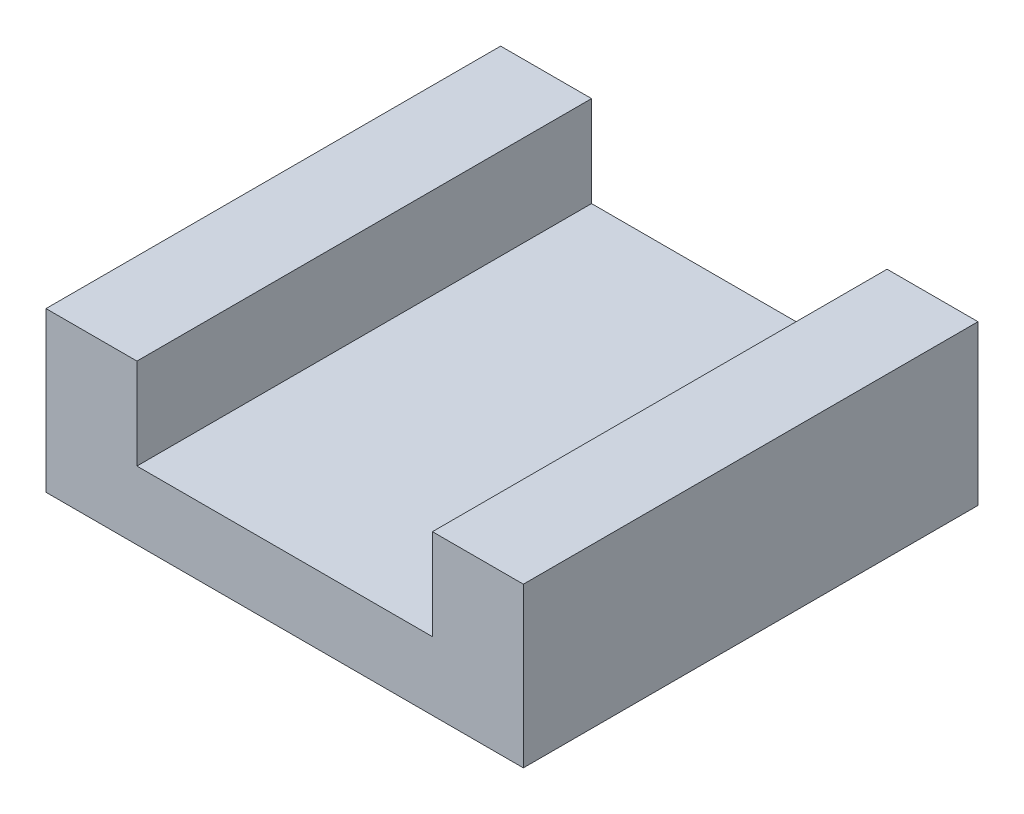
ISO-10303-21;
HEADER;
FILE_DESCRIPTION(('STEP AP214'),'2;1');
FILE_NAME('part.step','',(''),(''),'','','');
FILE_SCHEMA(('AUTOMOTIVE_DESIGN { 1 0 10303 214 1 1 1 1 }'));
ENDSEC;
DATA;
#1=APPLICATION_CONTEXT('core data for automotive mechanical design processes');
#2=APPLICATION_PROTOCOL_DEFINITION('international standard','automotive_design',2000,#1);
#3=PRODUCT_CONTEXT('',#1,'mechanical');
#4=PRODUCT('Part','Part','',(#3));
#5=PRODUCT_RELATED_PRODUCT_CATEGORY('part','',(#4));
#6=PRODUCT_DEFINITION_FORMATION('','',#4);
#7=PRODUCT_DEFINITION_CONTEXT('part definition',#1,'design');
#8=PRODUCT_DEFINITION('design','',#6,#7);
#9=PRODUCT_DEFINITION_SHAPE('','',#8);
#10=(LENGTH_UNIT() NAMED_UNIT(*) SI_UNIT(.MILLI.,.METRE.));
#11=(NAMED_UNIT(*) PLANE_ANGLE_UNIT() SI_UNIT($,.RADIAN.));
#12=(NAMED_UNIT(*) SI_UNIT($,.STERADIAN.) SOLID_ANGLE_UNIT());
#13=UNCERTAINTY_MEASURE_WITH_UNIT(LENGTH_MEASURE(1.E-05),#10,'distance_accuracy_value','');
#14=(GEOMETRIC_REPRESENTATION_CONTEXT(3) GLOBAL_UNCERTAINTY_ASSIGNED_CONTEXT((#13)) GLOBAL_UNIT_ASSIGNED_CONTEXT((#10,
#11,#12)) REPRESENTATION_CONTEXT('',''));
#15=CARTESIAN_POINT('',(0.,0.,0.));
#16=DIRECTION('',(0.,0.,1.));
#17=DIRECTION('',(1.,0.,0.));
#18=AXIS2_PLACEMENT_3D('',#15,#16,#17);
#19=CARTESIAN_POINT('',(-5.25,3.5,10.));
#20=DIRECTION('',(1.,0.,0.));
#21=DIRECTION('',(0.,0.,-1.));
#22=AXIS2_PLACEMENT_3D('',#19,#20,#21);
#23=PLANE('',#22);
#24=DIRECTION('',(0.,-1.,0.));
#25=VECTOR('',#24,1.);
#26=CARTESIAN_POINT('',(-5.25,3.5,0.));
#27=LINE('',#26,#25);
#28=CARTESIAN_POINT('',(-5.25,3.5,0.));
#29=VERTEX_POINT('',#28);
#30=CARTESIAN_POINT('',(-5.25,0.,0.));
#31=VERTEX_POINT('',#30);
#32=EDGE_CURVE('E129',#29,#31,#27,.T.);
#33=ORIENTED_EDGE('',*,*,#32,.T.);
#34=DIRECTION('',(0.,0.,-1.));
#35=VECTOR('',#34,1.);
#36=CARTESIAN_POINT('',(-5.25,0.,10.));
#37=LINE('',#36,#35);
#38=CARTESIAN_POINT('',(-5.25,0.,10.));
#39=VERTEX_POINT('',#38);
#40=EDGE_CURVE('E11',#39,#31,#37,.T.);
#41=ORIENTED_EDGE('',*,*,#40,.F.);
#42=DIRECTION('',(0.,-1.,0.));
#43=VECTOR('',#42,1.);
#44=CARTESIAN_POINT('',(-5.25,3.5,10.));
#45=LINE('',#44,#43);
#46=CARTESIAN_POINT('',(-5.25,3.5,10.));
#47=VERTEX_POINT('',#46);
#48=EDGE_CURVE('E143',#47,#39,#45,.T.);
#49=ORIENTED_EDGE('',*,*,#48,.F.);
#50=DIRECTION('',(0.,0.,-1.));
#51=VECTOR('',#50,1.);
#52=CARTESIAN_POINT('',(-5.25,3.5,10.));
#53=LINE('',#52,#51);
#54=EDGE_CURVE('E125',#47,#29,#53,.T.);
#55=ORIENTED_EDGE('',*,*,#54,.T.);
#56=EDGE_LOOP('',(#33,#41,#49,#55));
#57=FACE_BOUND('',#56,.T.);
#58=ADVANCED_FACE('F33',(#57),#23,.F.);
#59=CARTESIAN_POINT('',(-5.25,0.,10.));
#60=DIRECTION('',(0.,1.,0.));
#61=DIRECTION('',(0.,0.,1.));
#62=AXIS2_PLACEMENT_3D('',#59,#60,#61);
#63=PLANE('',#62);
#64=DIRECTION('',(1.,0.,0.));
#65=VECTOR('',#64,1.);
#66=CARTESIAN_POINT('',(-5.25,0.,0.));
#67=LINE('',#66,#65);
#68=CARTESIAN_POINT('',(5.25,0.,0.));
#69=VERTEX_POINT('',#68);
#70=EDGE_CURVE('E132',#31,#69,#67,.T.);
#71=ORIENTED_EDGE('',*,*,#70,.T.);
#72=DIRECTION('',(0.,0.,-1.));
#73=VECTOR('',#72,1.);
#74=CARTESIAN_POINT('',(5.25,0.,10.));
#75=LINE('',#74,#73);
#76=CARTESIAN_POINT('',(5.25,0.,10.));
#77=VERTEX_POINT('',#76);
#78=EDGE_CURVE('E41',#77,#69,#75,.T.);
#79=ORIENTED_EDGE('',*,*,#78,.F.);
#80=DIRECTION('',(1.,0.,0.));
#81=VECTOR('',#80,1.);
#82=CARTESIAN_POINT('',(-5.25,0.,10.));
#83=LINE('',#82,#81);
#84=EDGE_CURVE('E92',#39,#77,#83,.T.);
#85=ORIENTED_EDGE('',*,*,#84,.F.);
#86=ORIENTED_EDGE('',*,*,#40,.T.);
#87=EDGE_LOOP('',(#71,#79,#85,#86));
#88=FACE_BOUND('',#87,.T.);
#89=ADVANCED_FACE('F178',(#88),#63,.F.);
#90=CARTESIAN_POINT('',(5.25,3.5,10.));
#91=DIRECTION('',(-1.,0.,0.));
#92=DIRECTION('',(0.,0.,1.));
#93=AXIS2_PLACEMENT_3D('',#90,#91,#92);
#94=PLANE('',#93);
#95=DIRECTION('',(0.,1.,0.));
#96=VECTOR('',#95,1.);
#97=CARTESIAN_POINT('',(5.25,3.5,0.));
#98=LINE('',#97,#96);
#99=CARTESIAN_POINT('',(5.25,3.5,0.));
#100=VERTEX_POINT('',#99);
#101=EDGE_CURVE('E134',#69,#100,#98,.T.);
#102=ORIENTED_EDGE('',*,*,#101,.T.);
#103=DIRECTION('',(0.,0.,-1.));
#104=VECTOR('',#103,1.);
#105=CARTESIAN_POINT('',(5.25,3.5,10.));
#106=LINE('',#105,#104);
#107=CARTESIAN_POINT('',(5.25,3.5,10.));
#108=VERTEX_POINT('',#107);
#109=EDGE_CURVE('E150',#108,#100,#106,.T.);
#110=ORIENTED_EDGE('',*,*,#109,.F.);
#111=DIRECTION('',(0.,1.,0.));
#112=VECTOR('',#111,1.);
#113=CARTESIAN_POINT('',(5.25,3.5,10.));
#114=LINE('',#113,#112);
#115=EDGE_CURVE('E158',#77,#108,#114,.T.);
#116=ORIENTED_EDGE('',*,*,#115,.F.);
#117=ORIENTED_EDGE('',*,*,#78,.T.);
#118=EDGE_LOOP('',(#102,#110,#116,#117));
#119=FACE_BOUND('',#118,.T.);
#120=ADVANCED_FACE('F156',(#119),#94,.F.);
#121=CARTESIAN_POINT('',(3.25,3.5,10.));
#122=DIRECTION('',(0.,-1.,0.));
#123=DIRECTION('',(1.,0.,0.));
#124=AXIS2_PLACEMENT_3D('',#121,#122,#123);
#125=PLANE('',#124);
#126=DIRECTION('',(-1.,0.,0.));
#127=VECTOR('',#126,1.);
#128=CARTESIAN_POINT('',(3.25,3.5,0.));
#129=LINE('',#128,#127);
#130=CARTESIAN_POINT('',(3.25,3.5,0.));
#131=VERTEX_POINT('',#130);
#132=EDGE_CURVE('E136',#100,#131,#129,.T.);
#133=ORIENTED_EDGE('',*,*,#132,.T.);
#134=DIRECTION('',(0.,0.,-1.));
#135=VECTOR('',#134,1.);
#136=CARTESIAN_POINT('',(3.25,3.5,10.));
#137=LINE('',#136,#135);
#138=CARTESIAN_POINT('',(3.25,3.5,10.));
#139=VERTEX_POINT('',#138);
#140=EDGE_CURVE('E147',#139,#131,#137,.T.);
#141=ORIENTED_EDGE('',*,*,#140,.F.);
#142=DIRECTION('',(-1.,0.,0.));
#143=VECTOR('',#142,1.);
#144=CARTESIAN_POINT('',(3.25,3.5,10.));
#145=LINE('',#144,#143);
#146=EDGE_CURVE('E170',#108,#139,#145,.T.);
#147=ORIENTED_EDGE('',*,*,#146,.F.);
#148=ORIENTED_EDGE('',*,*,#109,.T.);
#149=EDGE_LOOP('',(#133,#141,#147,#148));
#150=FACE_BOUND('',#149,.T.);
#151=ADVANCED_FACE('F166',(#150),#125,.F.);
#152=CARTESIAN_POINT('',(3.25,3.5,10.));
#153=DIRECTION('',(1.,0.,0.));
#154=DIRECTION('',(0.,1.,0.));
#155=AXIS2_PLACEMENT_3D('',#152,#153,#154);
#156=PLANE('',#155);
#157=DIRECTION('',(0.,-1.,0.));
#158=VECTOR('',#157,1.);
#159=CARTESIAN_POINT('',(3.25,3.5,0.));
#160=LINE('',#159,#158);
#161=CARTESIAN_POINT('',(3.25,1.5,0.));
#162=VERTEX_POINT('',#161);
#163=EDGE_CURVE('E138',#131,#162,#160,.T.);
#164=ORIENTED_EDGE('',*,*,#163,.T.);
#165=DIRECTION('',(0.,0.,-1.));
#166=VECTOR('',#165,1.);
#167=CARTESIAN_POINT('',(3.25,1.5,10.));
#168=LINE('',#167,#166);
#169=CARTESIAN_POINT('',(3.25,1.5,10.));
#170=VERTEX_POINT('',#169);
#171=EDGE_CURVE('E120',#170,#162,#168,.T.);
#172=ORIENTED_EDGE('',*,*,#171,.F.);
#173=DIRECTION('',(0.,-1.,0.));
#174=VECTOR('',#173,1.);
#175=CARTESIAN_POINT('',(3.25,3.5,10.));
#176=LINE('',#175,#174);
#177=EDGE_CURVE('E111',#139,#170,#176,.T.);
#178=ORIENTED_EDGE('',*,*,#177,.F.);
#179=ORIENTED_EDGE('',*,*,#140,.T.);
#180=EDGE_LOOP('',(#164,#172,#178,#179));
#181=FACE_BOUND('',#180,.T.);
#182=ADVANCED_FACE('F169',(#181),#156,.F.);
#183=CARTESIAN_POINT('',(-3.25,1.5,10.));
#184=DIRECTION('',(0.,-1.,0.));
#185=DIRECTION('',(0.,0.,-1.));
#186=AXIS2_PLACEMENT_3D('',#183,#184,#185);
#187=PLANE('',#186);
#188=DIRECTION('',(-1.,0.,0.));
#189=VECTOR('',#188,1.);
#190=CARTESIAN_POINT('',(-3.25,1.5,0.));
#191=LINE('',#190,#189);
#192=CARTESIAN_POINT('',(-3.25,1.5,0.));
#193=VERTEX_POINT('',#192);
#194=EDGE_CURVE('E119',#162,#193,#191,.T.);
#195=ORIENTED_EDGE('',*,*,#194,.T.);
#196=DIRECTION('',(0.,0.,-1.));
#197=VECTOR('',#196,1.);
#198=CARTESIAN_POINT('',(-3.25,1.5,10.));
#199=LINE('',#198,#197);
#200=CARTESIAN_POINT('',(-3.25,1.5,10.));
#201=VERTEX_POINT('',#200);
#202=EDGE_CURVE('E116',#201,#193,#199,.T.);
#203=ORIENTED_EDGE('',*,*,#202,.F.);
#204=DIRECTION('',(-1.,0.,0.));
#205=VECTOR('',#204,1.);
#206=CARTESIAN_POINT('',(-3.25,1.5,10.));
#207=LINE('',#206,#205);
#208=EDGE_CURVE('E105',#170,#201,#207,.T.);
#209=ORIENTED_EDGE('',*,*,#208,.F.);
#210=ORIENTED_EDGE('',*,*,#171,.T.);
#211=EDGE_LOOP('',(#195,#203,#209,#210));
#212=FACE_BOUND('',#211,.T.);
#213=ADVANCED_FACE('F117',(#212),#187,.F.);
#214=CARTESIAN_POINT('',(-3.25,3.5,10.));
#215=DIRECTION('',(-1.,0.,0.));
#216=DIRECTION('',(0.,-1.,0.));
#217=AXIS2_PLACEMENT_3D('',#214,#215,#216);
#218=PLANE('',#217);
#219=DIRECTION('',(0.,1.,0.));
#220=VECTOR('',#219,1.);
#221=CARTESIAN_POINT('',(-3.25,3.5,0.));
#222=LINE('',#221,#220);
#223=CARTESIAN_POINT('',(-3.25,3.5,0.));
#224=VERTEX_POINT('',#223);
#225=EDGE_CURVE('E78',#193,#224,#222,.T.);
#226=ORIENTED_EDGE('',*,*,#225,.T.);
#227=DIRECTION('',(0.,0.,-1.));
#228=VECTOR('',#227,1.);
#229=CARTESIAN_POINT('',(-3.25,3.5,10.));
#230=LINE('',#229,#228);
#231=CARTESIAN_POINT('',(-3.25,3.5,10.));
#232=VERTEX_POINT('',#231);
#233=EDGE_CURVE('E121',#232,#224,#230,.T.);
#234=ORIENTED_EDGE('',*,*,#233,.F.);
#235=DIRECTION('',(0.,1.,0.));
#236=VECTOR('',#235,1.);
#237=CARTESIAN_POINT('',(-3.25,3.5,10.));
#238=LINE('',#237,#236);
#239=EDGE_CURVE('E109',#201,#232,#238,.T.);
#240=ORIENTED_EDGE('',*,*,#239,.F.);
#241=ORIENTED_EDGE('',*,*,#202,.T.);
#242=EDGE_LOOP('',(#226,#234,#240,#241));
#243=FACE_BOUND('',#242,.T.);
#244=ADVANCED_FACE('F123',(#243),#218,.F.);
#245=CARTESIAN_POINT('',(-5.25,3.5,10.));
#246=DIRECTION('',(0.,-1.,0.));
#247=DIRECTION('',(1.,0.,0.));
#248=AXIS2_PLACEMENT_3D('',#245,#246,#247);
#249=PLANE('',#248);
#250=DIRECTION('',(-1.,0.,0.));
#251=VECTOR('',#250,1.);
#252=CARTESIAN_POINT('',(-5.25,3.5,0.));
#253=LINE('',#252,#251);
#254=EDGE_CURVE('E84',#224,#29,#253,.T.);
#255=ORIENTED_EDGE('',*,*,#254,.T.);
#256=ORIENTED_EDGE('',*,*,#54,.F.);
#257=DIRECTION('',(-1.,0.,0.));
#258=VECTOR('',#257,1.);
#259=CARTESIAN_POINT('',(-5.25,3.5,10.));
#260=LINE('',#259,#258);
#261=EDGE_CURVE('E49',#232,#47,#260,.T.);
#262=ORIENTED_EDGE('',*,*,#261,.F.);
#263=ORIENTED_EDGE('',*,*,#233,.T.);
#264=EDGE_LOOP('',(#255,#256,#262,#263));
#265=FACE_BOUND('',#264,.T.);
#266=ADVANCED_FACE('F194',(#265),#249,.F.);
#267=CARTESIAN_POINT('',(0.,0.,10.));
#268=DIRECTION('',(0.,0.,1.));
#269=DIRECTION('',(1.,0.,0.));
#270=AXIS2_PLACEMENT_3D('',#267,#268,#269);
#271=PLANE('',#270);
#272=ORIENTED_EDGE('',*,*,#48,.T.);
#273=ORIENTED_EDGE('',*,*,#84,.T.);
#274=ORIENTED_EDGE('',*,*,#115,.T.);
#275=ORIENTED_EDGE('',*,*,#146,.T.);
#276=ORIENTED_EDGE('',*,*,#177,.T.);
#277=ORIENTED_EDGE('',*,*,#208,.T.);
#278=ORIENTED_EDGE('',*,*,#239,.T.);
#279=ORIENTED_EDGE('',*,*,#261,.T.);
#280=EDGE_LOOP('',(#272,#273,#274,#275,#276,#277,#278,#279));
#281=FACE_BOUND('',#280,.T.);
#282=ADVANCED_FACE('F107',(#281),#271,.T.);
#283=CARTESIAN_POINT('',(0.,0.,0.));
#284=DIRECTION('',(0.,0.,1.));
#285=DIRECTION('',(1.,0.,0.));
#286=AXIS2_PLACEMENT_3D('',#283,#284,#285);
#287=PLANE('',#286);
#288=ORIENTED_EDGE('',*,*,#32,.F.);
#289=ORIENTED_EDGE('',*,*,#254,.F.);
#290=ORIENTED_EDGE('',*,*,#225,.F.);
#291=ORIENTED_EDGE('',*,*,#194,.F.);
#292=ORIENTED_EDGE('',*,*,#163,.F.);
#293=ORIENTED_EDGE('',*,*,#132,.F.);
#294=ORIENTED_EDGE('',*,*,#101,.F.);
#295=ORIENTED_EDGE('',*,*,#70,.F.);
#296=EDGE_LOOP('',(#288,#289,#290,#291,#292,#293,#294,#295));
#297=FACE_BOUND('',#296,.T.);
#298=ADVANCED_FACE('F162',(#297),#287,.F.);
#299=CLOSED_SHELL('',(#58,#89,#120,#151,#182,#213,#244,#266,#282,#298));
#300=MANIFOLD_SOLID_BREP('B2',#299);
#301=ADVANCED_BREP_SHAPE_REPRESENTATION('',(#18,#300),#14);
#302=SHAPE_DEFINITION_REPRESENTATION(#9,#301);
ENDSEC;
END-ISO-10303-21;
